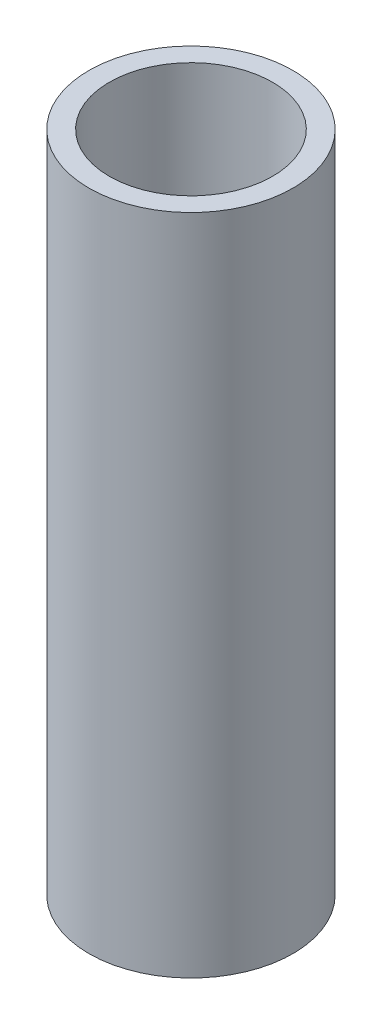
ISO-10303-21;
HEADER;
FILE_DESCRIPTION(('STEP AP214'),'2;1');
FILE_NAME('part.step','',(''),(''),'','','');
FILE_SCHEMA(('AUTOMOTIVE_DESIGN { 1 0 10303 214 1 1 1 1 }'));
ENDSEC;
DATA;
#1=APPLICATION_CONTEXT('core data for automotive mechanical design processes');
#2=APPLICATION_PROTOCOL_DEFINITION('international standard','automotive_design',2000,#1);
#3=PRODUCT_CONTEXT('',#1,'mechanical');
#4=PRODUCT('Part','Part','',(#3));
#5=PRODUCT_RELATED_PRODUCT_CATEGORY('part','',(#4));
#6=PRODUCT_DEFINITION_FORMATION('','',#4);
#7=PRODUCT_DEFINITION_CONTEXT('part definition',#1,'design');
#8=PRODUCT_DEFINITION('design','',#6,#7);
#9=PRODUCT_DEFINITION_SHAPE('','',#8);
#10=(LENGTH_UNIT() NAMED_UNIT(*) SI_UNIT(.MILLI.,.METRE.));
#11=(NAMED_UNIT(*) PLANE_ANGLE_UNIT() SI_UNIT($,.RADIAN.));
#12=(NAMED_UNIT(*) SI_UNIT($,.STERADIAN.) SOLID_ANGLE_UNIT());
#13=UNCERTAINTY_MEASURE_WITH_UNIT(LENGTH_MEASURE(1.E-05),#10,'distance_accuracy_value','');
#14=(GEOMETRIC_REPRESENTATION_CONTEXT(3) GLOBAL_UNCERTAINTY_ASSIGNED_CONTEXT((#13)) GLOBAL_UNIT_ASSIGNED_CONTEXT((#10,
#11,#12)) REPRESENTATION_CONTEXT('',''));
#15=CARTESIAN_POINT('',(0.,0.,0.));
#16=DIRECTION('',(0.,0.,1.));
#17=DIRECTION('',(1.,0.,0.));
#18=AXIS2_PLACEMENT_3D('',#15,#16,#17);
#19=CARTESIAN_POINT('',(0.,206.375,0.));
#20=DIRECTION('',(0.,1.,0.));
#21=DIRECTION('',(0.,0.,1.));
#22=AXIS2_PLACEMENT_3D('',#19,#20,#21);
#23=PLANE('',#22);
#24=CARTESIAN_POINT('',(0.,206.375,0.));
#25=DIRECTION('',(0.,1.,0.));
#26=DIRECTION('',(0.,0.,1.));
#27=AXIS2_PLACEMENT_3D('',#24,#25,#26);
#28=CIRCLE('',#27,31.75);
#29=CARTESIAN_POINT('',(0.,206.375,31.75));
#30=VERTEX_POINT('',#29);
#31=EDGE_CURVE('E10',#30,#30,#28,.T.);
#32=ORIENTED_EDGE('',*,*,#31,.T.);
#33=EDGE_LOOP('',(#32));
#34=FACE_BOUND('',#33,.T.);
#35=CARTESIAN_POINT('',(0.,206.375,0.));
#36=DIRECTION('',(0.,1.,0.));
#37=DIRECTION('',(0.,0.,1.));
#38=AXIS2_PLACEMENT_3D('',#35,#36,#37);
#39=CIRCLE('',#38,25.4);
#40=CARTESIAN_POINT('',(0.,206.375,25.4));
#41=VERTEX_POINT('',#40);
#42=EDGE_CURVE('E42',#41,#41,#39,.T.);
#43=ORIENTED_EDGE('',*,*,#42,.F.);
#44=EDGE_LOOP('',(#43));
#45=FACE_BOUND('',#44,.T.);
#46=ADVANCED_FACE('F31',(#34,#45),#23,.T.);
#47=CARTESIAN_POINT('',(0.,0.,0.));
#48=DIRECTION('',(0.,1.,0.));
#49=DIRECTION('',(0.,0.,1.));
#50=AXIS2_PLACEMENT_3D('',#47,#48,#49);
#51=PLANE('',#50);
#52=CARTESIAN_POINT('',(0.,0.,0.));
#53=DIRECTION('',(0.,1.,0.));
#54=DIRECTION('',(0.,0.,1.));
#55=AXIS2_PLACEMENT_3D('',#52,#53,#54);
#56=CIRCLE('',#55,31.75);
#57=CARTESIAN_POINT('',(0.,0.,31.75));
#58=VERTEX_POINT('',#57);
#59=EDGE_CURVE('E35',#58,#58,#56,.T.);
#60=ORIENTED_EDGE('',*,*,#59,.F.);
#61=EDGE_LOOP('',(#60));
#62=FACE_BOUND('',#61,.T.);
#63=CARTESIAN_POINT('',(0.,0.,0.));
#64=DIRECTION('',(0.,1.,0.));
#65=DIRECTION('',(0.,0.,1.));
#66=AXIS2_PLACEMENT_3D('',#63,#64,#65);
#67=CIRCLE('',#66,25.4);
#68=CARTESIAN_POINT('',(0.,0.,25.4));
#69=VERTEX_POINT('',#68);
#70=EDGE_CURVE('E44',#69,#69,#67,.T.);
#71=ORIENTED_EDGE('',*,*,#70,.T.);
#72=EDGE_LOOP('',(#71));
#73=FACE_BOUND('',#72,.T.);
#74=ADVANCED_FACE('F54',(#62,#73),#51,.F.);
#75=CARTESIAN_POINT('',(0.,206.375,0.));
#76=DIRECTION('',(0.,-1.,0.));
#77=DIRECTION('',(0.,0.,-1.));
#78=AXIS2_PLACEMENT_3D('',#75,#76,#77);
#79=CYLINDRICAL_SURFACE('',#78,31.75);
#80=ORIENTED_EDGE('',*,*,#31,.F.);
#81=EDGE_LOOP('',(#80));
#82=FACE_BOUND('',#81,.T.);
#83=ORIENTED_EDGE('',*,*,#59,.T.);
#84=EDGE_LOOP('',(#83));
#85=FACE_BOUND('',#84,.T.);
#86=ADVANCED_FACE('F33',(#82,#85),#79,.T.);
#87=CARTESIAN_POINT('',(0.,206.375,0.));
#88=DIRECTION('',(0.,-1.,0.));
#89=DIRECTION('',(0.,0.,-1.));
#90=AXIS2_PLACEMENT_3D('',#87,#88,#89);
#91=CYLINDRICAL_SURFACE('',#90,25.4);
#92=ORIENTED_EDGE('',*,*,#42,.T.);
#93=EDGE_LOOP('',(#92));
#94=FACE_BOUND('',#93,.T.);
#95=ORIENTED_EDGE('',*,*,#70,.F.);
#96=EDGE_LOOP('',(#95));
#97=FACE_BOUND('',#96,.T.);
#98=ADVANCED_FACE('F50',(#94,#97),#91,.F.);
#99=CLOSED_SHELL('',(#46,#74,#86,#98));
#100=MANIFOLD_SOLID_BREP('B2',#99);
#101=ADVANCED_BREP_SHAPE_REPRESENTATION('',(#18,#100),#14);
#102=SHAPE_DEFINITION_REPRESENTATION(#9,#101);
ENDSEC;
END-ISO-10303-21;
